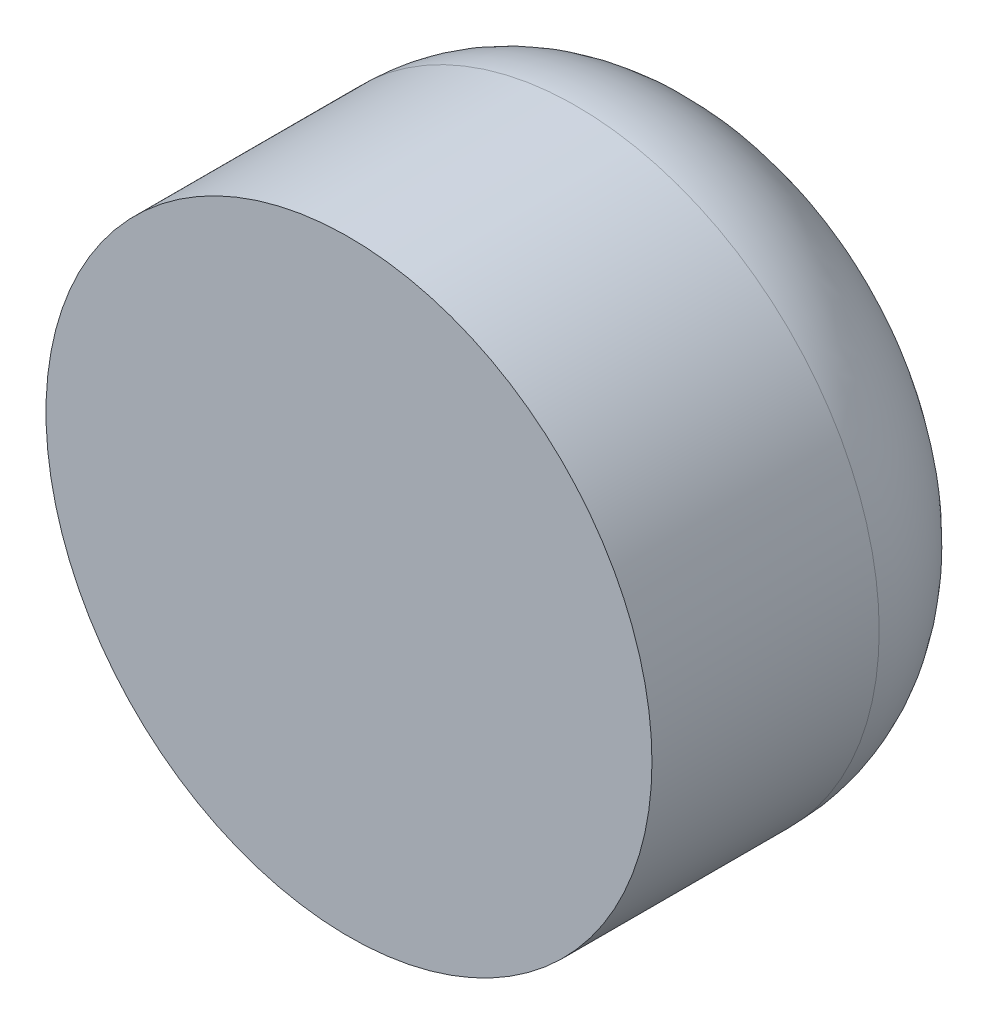
ISO-10303-21;
HEADER;
FILE_DESCRIPTION(('STEP AP214'),'2;1');
FILE_NAME('part.step','',(''),(''),'','','');
FILE_SCHEMA(('AUTOMOTIVE_DESIGN { 1 0 10303 214 1 1 1 1 }'));
ENDSEC;
DATA;
#1=APPLICATION_CONTEXT('core data for automotive mechanical design processes');
#2=APPLICATION_PROTOCOL_DEFINITION('international standard','automotive_design',2000,#1);
#3=PRODUCT_CONTEXT('',#1,'mechanical');
#4=PRODUCT('Part','Part','',(#3));
#5=PRODUCT_RELATED_PRODUCT_CATEGORY('part','',(#4));
#6=PRODUCT_DEFINITION_FORMATION('','',#4);
#7=PRODUCT_DEFINITION_CONTEXT('part definition',#1,'design');
#8=PRODUCT_DEFINITION('design','',#6,#7);
#9=PRODUCT_DEFINITION_SHAPE('','',#8);
#10=(LENGTH_UNIT() NAMED_UNIT(*) SI_UNIT(.MILLI.,.METRE.));
#11=(NAMED_UNIT(*) PLANE_ANGLE_UNIT() SI_UNIT($,.RADIAN.));
#12=(NAMED_UNIT(*) SI_UNIT($,.STERADIAN.) SOLID_ANGLE_UNIT());
#13=UNCERTAINTY_MEASURE_WITH_UNIT(LENGTH_MEASURE(1.E-05),#10,'distance_accuracy_value','');
#14=(GEOMETRIC_REPRESENTATION_CONTEXT(3) GLOBAL_UNCERTAINTY_ASSIGNED_CONTEXT((#13)) GLOBAL_UNIT_ASSIGNED_CONTEXT((#10,
#11,#12)) REPRESENTATION_CONTEXT('',''));
#15=CARTESIAN_POINT('',(0.,0.,0.));
#16=DIRECTION('',(0.,0.,1.));
#17=DIRECTION('',(1.,0.,0.));
#18=AXIS2_PLACEMENT_3D('',#15,#16,#17);
#19=CARTESIAN_POINT('',(0.,0.,5.));
#20=DIRECTION('',(0.,0.,-1.));
#21=DIRECTION('',(-1.,0.,0.));
#22=AXIS2_PLACEMENT_3D('',#19,#20,#21);
#23=CYLINDRICAL_SURFACE('',#22,4.);
#24=CARTESIAN_POINT('',(0.,0.,2.));
#25=DIRECTION('',(0.,0.,1.));
#26=DIRECTION('',(1.,0.,0.));
#27=AXIS2_PLACEMENT_3D('',#24,#25,#26);
#28=CIRCLE('',#27,4.);
#29=CARTESIAN_POINT('',(4.,0.,2.));
#30=VERTEX_POINT('',#29);
#31=EDGE_CURVE('E41',#30,#30,#28,.T.);
#32=ORIENTED_EDGE('',*,*,#31,.T.);
#33=EDGE_LOOP('',(#32));
#34=FACE_BOUND('',#33,.T.);
#35=CARTESIAN_POINT('',(0.,0.,5.));
#36=DIRECTION('',(0.,0.,1.));
#37=DIRECTION('',(1.,0.,0.));
#38=AXIS2_PLACEMENT_3D('',#35,#36,#37);
#39=CIRCLE('',#38,4.);
#40=CARTESIAN_POINT('',(4.,0.,5.));
#41=VERTEX_POINT('',#40);
#42=EDGE_CURVE('E45',#41,#41,#39,.T.);
#43=ORIENTED_EDGE('',*,*,#42,.F.);
#44=EDGE_LOOP('',(#43));
#45=FACE_BOUND('',#44,.T.);
#46=ADVANCED_FACE('F34',(#34,#45),#23,.T.);
#47=CARTESIAN_POINT('',(0.,0.,5.));
#48=DIRECTION('',(0.,0.,1.));
#49=DIRECTION('',(1.,0.,0.));
#50=AXIS2_PLACEMENT_3D('',#47,#48,#49);
#51=PLANE('',#50);
#52=ORIENTED_EDGE('',*,*,#42,.T.);
#53=EDGE_LOOP('',(#52));
#54=FACE_BOUND('',#53,.T.);
#55=ADVANCED_FACE('F52',(#54),#51,.T.);
#56=CARTESIAN_POINT('',(0.,0.,0.));
#57=DIRECTION('',(0.,0.,1.));
#58=DIRECTION('',(1.,0.,0.));
#59=AXIS2_PLACEMENT_3D('',#56,#57,#58);
#60=PLANE('',#59);
#61=CARTESIAN_POINT('',(0.,0.,0.));
#62=DIRECTION('',(0.,0.,1.));
#63=DIRECTION('',(1.,0.,0.));
#64=AXIS2_PLACEMENT_3D('',#61,#62,#63);
#65=CIRCLE('',#64,2.);
#66=CARTESIAN_POINT('',(2.,0.,0.));
#67=VERTEX_POINT('',#66);
#68=EDGE_CURVE('E10',#67,#67,#65,.F.);
#69=ORIENTED_EDGE('',*,*,#68,.T.);
#70=EDGE_LOOP('',(#69));
#71=FACE_BOUND('',#70,.T.);
#72=ADVANCED_FACE('F58',(#71),#60,.F.);
#73=CARTESIAN_POINT('',(0.,0.,2.));
#74=DIRECTION('',(0.,0.,1.));
#75=DIRECTION('',(1.,0.,0.));
#76=AXIS2_PLACEMENT_3D('',#73,#74,#75);
#77=DEGENERATE_TOROIDAL_SURFACE('',#76,2.,2.,.T.);
#78=ORIENTED_EDGE('',*,*,#68,.F.);
#79=EDGE_LOOP('',(#78));
#80=FACE_BOUND('',#79,.T.);
#81=ORIENTED_EDGE('',*,*,#31,.F.);
#82=EDGE_LOOP('',(#81));
#83=FACE_BOUND('',#82,.T.);
#84=ADVANCED_FACE('F36',(#80,#83),#77,.T.);
#85=CLOSED_SHELL('',(#46,#55,#72,#84));
#86=MANIFOLD_SOLID_BREP('B2',#85);
#87=ADVANCED_BREP_SHAPE_REPRESENTATION('',(#18,#86),#14);
#88=SHAPE_DEFINITION_REPRESENTATION(#9,#87);
ENDSEC;
END-ISO-10303-21;
